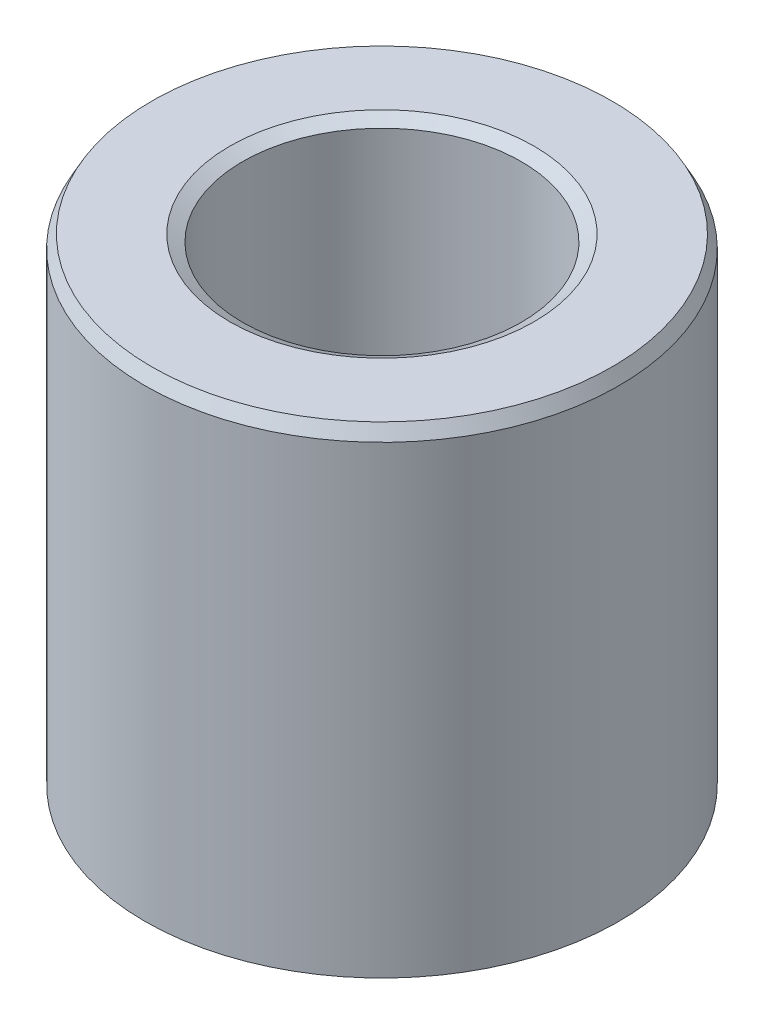
ISO-10303-21;
HEADER;
FILE_DESCRIPTION(('STEP AP214'),'2;1');
FILE_NAME('part.step','',(''),(''),'','','');
FILE_SCHEMA(('AUTOMOTIVE_DESIGN { 1 0 10303 214 1 1 1 1 }'));
ENDSEC;
DATA;
#1=APPLICATION_CONTEXT('core data for automotive mechanical design processes');
#2=APPLICATION_PROTOCOL_DEFINITION('international standard','automotive_design',2000,#1);
#3=PRODUCT_CONTEXT('',#1,'mechanical');
#4=PRODUCT('Part','Part','',(#3));
#5=PRODUCT_RELATED_PRODUCT_CATEGORY('part','',(#4));
#6=PRODUCT_DEFINITION_FORMATION('','',#4);
#7=PRODUCT_DEFINITION_CONTEXT('part definition',#1,'design');
#8=PRODUCT_DEFINITION('design','',#6,#7);
#9=PRODUCT_DEFINITION_SHAPE('','',#8);
#10=(LENGTH_UNIT() NAMED_UNIT(*) SI_UNIT(.MILLI.,.METRE.));
#11=(NAMED_UNIT(*) PLANE_ANGLE_UNIT() SI_UNIT($,.RADIAN.));
#12=(NAMED_UNIT(*) SI_UNIT($,.STERADIAN.) SOLID_ANGLE_UNIT());
#13=UNCERTAINTY_MEASURE_WITH_UNIT(LENGTH_MEASURE(1.E-05),#10,'distance_accuracy_value','');
#14=(GEOMETRIC_REPRESENTATION_CONTEXT(3) GLOBAL_UNCERTAINTY_ASSIGNED_CONTEXT((#13)) GLOBAL_UNIT_ASSIGNED_CONTEXT((#10,
#11,#12)) REPRESENTATION_CONTEXT('',''));
#15=CARTESIAN_POINT('',(0.,0.,0.));
#16=DIRECTION('',(0.,0.,1.));
#17=DIRECTION('',(1.,0.,0.));
#18=AXIS2_PLACEMENT_3D('',#15,#16,#17);
#19=CARTESIAN_POINT('',(0.,45.8929577673727,0.));
#20=DIRECTION('',(0.,-1.,0.));
#21=DIRECTION('',(0.,0.,-1.));
#22=AXIS2_PLACEMENT_3D('',#19,#20,#21);
#23=CYLINDRICAL_SURFACE('',#22,22.5);
#24=CARTESIAN_POINT('',(0.,0.657686702685865,0.));
#25=DIRECTION('',(0.,1.,0.));
#26=DIRECTION('',(0.,0.,1.));
#27=AXIS2_PLACEMENT_3D('',#24,#25,#26);
#28=CIRCLE('',#27,22.5);
#29=CARTESIAN_POINT('',(0.,0.657686702685865,22.5));
#30=VERTEX_POINT('',#29);
#31=EDGE_CURVE('E10',#30,#30,#28,.T.);
#32=ORIENTED_EDGE('',*,*,#31,.T.);
#33=EDGE_LOOP('',(#32));
#34=FACE_BOUND('',#33,.T.);
#35=CARTESIAN_POINT('',(0.,44.6771452206462,0.));
#36=DIRECTION('',(0.,1.,0.));
#37=DIRECTION('',(0.,0.,1.));
#38=AXIS2_PLACEMENT_3D('',#35,#36,#37);
#39=CIRCLE('',#38,22.5);
#40=CARTESIAN_POINT('',(0.,44.6771452206462,22.5));
#41=VERTEX_POINT('',#40);
#42=EDGE_CURVE('E50',#41,#41,#39,.F.);
#43=ORIENTED_EDGE('',*,*,#42,.T.);
#44=EDGE_LOOP('',(#43));
#45=FACE_BOUND('',#44,.T.);
#46=ADVANCED_FACE('F39',(#34,#45),#23,.T.);
#47=CARTESIAN_POINT('',(0.,45.8929577673727,0.));
#48=DIRECTION('',(0.,1.,0.));
#49=DIRECTION('',(0.,0.,1.));
#50=AXIS2_PLACEMENT_3D('',#47,#48,#49);
#51=PLANE('',#50);
#52=CARTESIAN_POINT('',(0.,45.8929577673727,0.));
#53=DIRECTION('',(0.,1.,0.));
#54=DIRECTION('',(0.,0.,1.));
#55=AXIS2_PLACEMENT_3D('',#52,#53,#54);
#56=CIRCLE('',#55,14.4365286345728);
#57=CARTESIAN_POINT('',(0.,45.8929577673727,14.4365286345728));
#58=VERTEX_POINT('',#57);
#59=EDGE_CURVE('E58',#58,#58,#56,.F.);
#60=ORIENTED_EDGE('',*,*,#59,.T.);
#61=EDGE_LOOP('',(#60));
#62=FACE_BOUND('',#61,.T.);
#63=CARTESIAN_POINT('',(0.,45.8929577673727,0.));
#64=DIRECTION('',(0.,1.,0.));
#65=DIRECTION('',(0.,0.,1.));
#66=AXIS2_PLACEMENT_3D('',#63,#64,#65);
#67=CIRCLE('',#66,21.8423132973142);
#68=CARTESIAN_POINT('',(0.,45.8929577673727,21.8423132973142));
#69=VERTEX_POINT('',#68);
#70=EDGE_CURVE('E61',#69,#69,#67,.T.);
#71=ORIENTED_EDGE('',*,*,#70,.T.);
#72=EDGE_LOOP('',(#71));
#73=FACE_BOUND('',#72,.T.);
#74=ADVANCED_FACE('F88',(#62,#73),#51,.T.);
#75=CARTESIAN_POINT('',(0.,0.,0.));
#76=DIRECTION('',(0.,1.,0.));
#77=DIRECTION('',(0.,0.,1.));
#78=AXIS2_PLACEMENT_3D('',#75,#76,#77);
#79=PLANE('',#78);
#80=CARTESIAN_POINT('',(0.,0.,0.));
#81=DIRECTION('',(0.,1.,0.));
#82=DIRECTION('',(0.,0.,1.));
#83=AXIS2_PLACEMENT_3D('',#80,#81,#82);
#84=CIRCLE('',#83,13.8784027905322);
#85=CARTESIAN_POINT('',(0.,0.,13.8784027905322));
#86=VERTEX_POINT('',#85);
#87=EDGE_CURVE('E51',#86,#86,#84,.T.);
#88=ORIENTED_EDGE('',*,*,#87,.T.);
#89=EDGE_LOOP('',(#88));
#90=FACE_BOUND('',#89,.T.);
#91=CARTESIAN_POINT('',(0.,0.,0.));
#92=DIRECTION('',(0.,1.,0.));
#93=DIRECTION('',(0.,0.,1.));
#94=AXIS2_PLACEMENT_3D('',#91,#92,#93);
#95=CIRCLE('',#94,21.2841874532735);
#96=CARTESIAN_POINT('',(0.,0.,21.2841874532735));
#97=VERTEX_POINT('',#96);
#98=EDGE_CURVE('E54',#97,#97,#95,.F.);
#99=ORIENTED_EDGE('',*,*,#98,.T.);
#100=EDGE_LOOP('',(#99));
#101=FACE_BOUND('',#100,.T.);
#102=ADVANCED_FACE('F83',(#90,#101),#79,.F.);
#103=CARTESIAN_POINT('',(0.,45.8929577673727,0.));
#104=DIRECTION('',(0.,-1.,0.));
#105=DIRECTION('',(0.,0.,-1.));
#106=AXIS2_PLACEMENT_3D('',#103,#104,#105);
#107=CYLINDRICAL_SURFACE('',#106,13.2207160878463);
#108=CARTESIAN_POINT('',(0.,45.2352710646869,0.));
#109=DIRECTION('',(0.,1.,0.));
#110=DIRECTION('',(0.,0.,1.));
#111=AXIS2_PLACEMENT_3D('',#108,#109,#110);
#112=CIRCLE('',#111,13.2207160878463);
#113=CARTESIAN_POINT('',(0.,45.2352710646869,13.2207160878463));
#114=VERTEX_POINT('',#113);
#115=EDGE_CURVE('E67',#114,#114,#112,.T.);
#116=ORIENTED_EDGE('',*,*,#115,.T.);
#117=EDGE_LOOP('',(#116));
#118=FACE_BOUND('',#117,.T.);
#119=CARTESIAN_POINT('',(0.,1.2158125467265,0.));
#120=DIRECTION('',(0.,1.,0.));
#121=DIRECTION('',(0.,0.,1.));
#122=AXIS2_PLACEMENT_3D('',#119,#120,#121);
#123=CIRCLE('',#122,13.2207160878463);
#124=CARTESIAN_POINT('',(0.,1.2158125467265,13.2207160878463));
#125=VERTEX_POINT('',#124);
#126=EDGE_CURVE('E69',#125,#125,#123,.F.);
#127=ORIENTED_EDGE('',*,*,#126,.T.);
#128=EDGE_LOOP('',(#127));
#129=FACE_BOUND('',#128,.T.);
#130=ADVANCED_FACE('F71',(#118,#129),#107,.F.);
#131=CARTESIAN_POINT('',(0.,45.2352710646869,0.));
#132=DIRECTION('',(0.,1.,0.));
#133=DIRECTION('',(0.,0.,1.));
#134=AXIS2_PLACEMENT_3D('',#131,#132,#133);
#135=CONICAL_SURFACE('',#134,13.2207160878463,1.07493234784709);
#136=ORIENTED_EDGE('',*,*,#59,.F.);
#137=EDGE_LOOP('',(#136));
#138=FACE_BOUND('',#137,.T.);
#139=ORIENTED_EDGE('',*,*,#115,.F.);
#140=EDGE_LOOP('',(#139));
#141=FACE_BOUND('',#140,.T.);
#142=ADVANCED_FACE('F77',(#138,#141),#135,.F.);
#143=CARTESIAN_POINT('',(0.,0.,0.));
#144=DIRECTION('',(0.,-1.,0.));
#145=DIRECTION('',(0.,0.,-1.));
#146=AXIS2_PLACEMENT_3D('',#143,#144,#145);
#147=CONICAL_SURFACE('',#146,13.8784027905322,0.495863978947808);
#148=ORIENTED_EDGE('',*,*,#126,.F.);
#149=EDGE_LOOP('',(#148));
#150=FACE_BOUND('',#149,.T.);
#151=ORIENTED_EDGE('',*,*,#87,.F.);
#152=EDGE_LOOP('',(#151));
#153=FACE_BOUND('',#152,.T.);
#154=ADVANCED_FACE('F73',(#150,#153),#147,.F.);
#155=CARTESIAN_POINT('',(0.,0.657686702685865,0.));
#156=DIRECTION('',(0.,1.,0.));
#157=DIRECTION('',(0.,0.,1.));
#158=AXIS2_PLACEMENT_3D('',#155,#156,#157);
#159=CONICAL_SURFACE('',#158,22.5,1.07493234784709);
#160=ORIENTED_EDGE('',*,*,#98,.F.);
#161=EDGE_LOOP('',(#160));
#162=FACE_BOUND('',#161,.T.);
#163=ORIENTED_EDGE('',*,*,#31,.F.);
#164=EDGE_LOOP('',(#163));
#165=FACE_BOUND('',#164,.T.);
#166=ADVANCED_FACE('F76',(#162,#165),#159,.T.);
#167=CARTESIAN_POINT('',(0.,45.8929577673727,0.));
#168=DIRECTION('',(0.,-1.,0.));
#169=DIRECTION('',(0.,0.,-1.));
#170=AXIS2_PLACEMENT_3D('',#167,#168,#169);
#171=CONICAL_SURFACE('',#170,21.8423132973142,0.495863978947804);
#172=ORIENTED_EDGE('',*,*,#42,.F.);
#173=EDGE_LOOP('',(#172));
#174=FACE_BOUND('',#173,.T.);
#175=ORIENTED_EDGE('',*,*,#70,.F.);
#176=EDGE_LOOP('',(#175));
#177=FACE_BOUND('',#176,.T.);
#178=ADVANCED_FACE('F45',(#174,#177),#171,.T.);
#179=CLOSED_SHELL('',(#46,#74,#102,#130,#142,#154,#166,#178));
#180=MANIFOLD_SOLID_BREP('B2',#179);
#181=ADVANCED_BREP_SHAPE_REPRESENTATION('',(#18,#180),#14);
#182=SHAPE_DEFINITION_REPRESENTATION(#9,#181);
ENDSEC;
END-ISO-10303-21;
